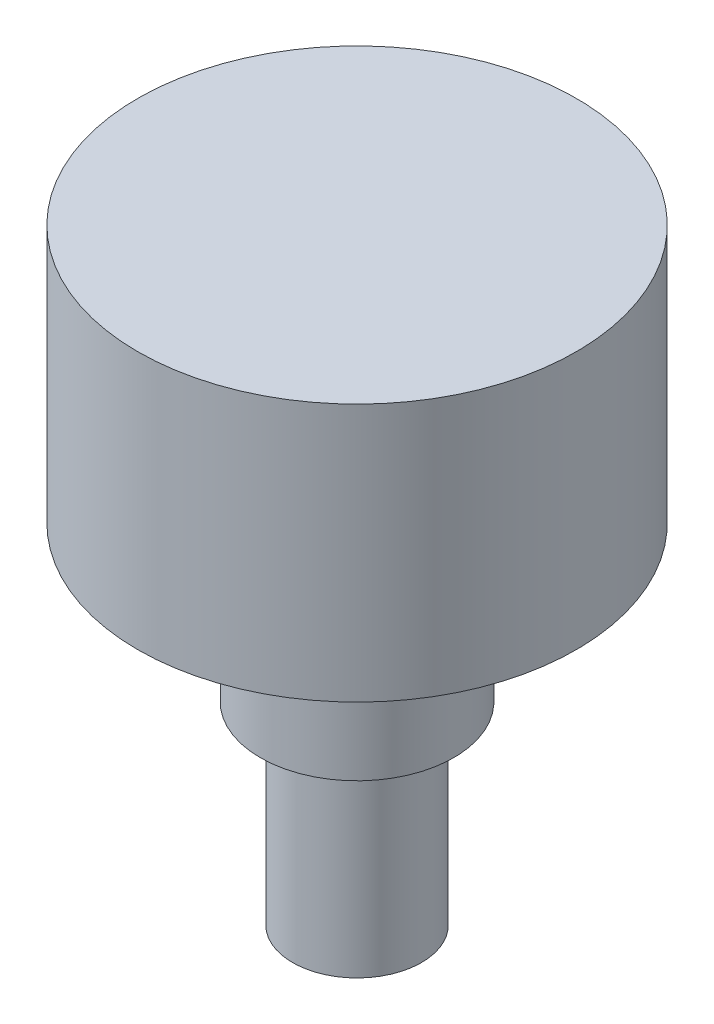
ISO-10303-21;
HEADER;
FILE_DESCRIPTION(('STEP AP214'),'2;1');
FILE_NAME('part.step','',(''),(''),'','','');
FILE_SCHEMA(('AUTOMOTIVE_DESIGN { 1 0 10303 214 1 1 1 1 }'));
ENDSEC;
DATA;
#1=APPLICATION_CONTEXT('core data for automotive mechanical design processes');
#2=APPLICATION_PROTOCOL_DEFINITION('international standard','automotive_design',2000,#1);
#3=PRODUCT_CONTEXT('',#1,'mechanical');
#4=PRODUCT('Part','Part','',(#3));
#5=PRODUCT_RELATED_PRODUCT_CATEGORY('part','',(#4));
#6=PRODUCT_DEFINITION_FORMATION('','',#4);
#7=PRODUCT_DEFINITION_CONTEXT('part definition',#1,'design');
#8=PRODUCT_DEFINITION('design','',#6,#7);
#9=PRODUCT_DEFINITION_SHAPE('','',#8);
#10=(LENGTH_UNIT() NAMED_UNIT(*) SI_UNIT(.MILLI.,.METRE.));
#11=(NAMED_UNIT(*) PLANE_ANGLE_UNIT() SI_UNIT($,.RADIAN.));
#12=(NAMED_UNIT(*) SI_UNIT($,.STERADIAN.) SOLID_ANGLE_UNIT());
#13=UNCERTAINTY_MEASURE_WITH_UNIT(LENGTH_MEASURE(1.E-05),#10,'distance_accuracy_value','');
#14=(GEOMETRIC_REPRESENTATION_CONTEXT(3) GLOBAL_UNCERTAINTY_ASSIGNED_CONTEXT((#13)) GLOBAL_UNIT_ASSIGNED_CONTEXT((#10,
#11,#12)) REPRESENTATION_CONTEXT('',''));
#15=CARTESIAN_POINT('',(0.,0.,0.));
#16=DIRECTION('',(0.,0.,1.));
#17=DIRECTION('',(1.,0.,0.));
#18=AXIS2_PLACEMENT_3D('',#15,#16,#17);
#19=CARTESIAN_POINT('',(0.,-17.145,0.));
#20=DIRECTION('',(0.,1.,0.));
#21=DIRECTION('',(0.,0.,1.));
#22=AXIS2_PLACEMENT_3D('',#19,#20,#21);
#23=CYLINDRICAL_SURFACE('',#22,4.7625);
#24=CARTESIAN_POINT('',(0.,0.,0.));
#25=DIRECTION('',(0.,1.,0.));
#26=DIRECTION('',(0.,0.,1.));
#27=AXIS2_PLACEMENT_3D('',#24,#25,#26);
#28=CIRCLE('',#27,4.7625);
#29=CARTESIAN_POINT('',(0.,0.,4.7625));
#30=VERTEX_POINT('',#29);
#31=EDGE_CURVE('E11',#30,#30,#28,.F.);
#32=ORIENTED_EDGE('',*,*,#31,.T.);
#33=EDGE_LOOP('',(#32));
#34=FACE_BOUND('',#33,.T.);
#35=CARTESIAN_POINT('',(0.,-7.62,0.));
#36=DIRECTION('',(0.,-1.,0.));
#37=DIRECTION('',(0.,0.,-1.));
#38=AXIS2_PLACEMENT_3D('',#35,#36,#37);
#39=CIRCLE('',#38,4.7625);
#40=CARTESIAN_POINT('',(0.,-7.62,-4.7625));
#41=VERTEX_POINT('',#40);
#42=EDGE_CURVE('E39',#41,#41,#39,.T.);
#43=ORIENTED_EDGE('',*,*,#42,.F.);
#44=EDGE_LOOP('',(#43));
#45=FACE_BOUND('',#44,.T.);
#46=ADVANCED_FACE('F35',(#34,#45),#23,.T.);
#47=CARTESIAN_POINT('',(0.,0.,0.));
#48=DIRECTION('',(0.,1.,0.));
#49=DIRECTION('',(0.,0.,1.));
#50=AXIS2_PLACEMENT_3D('',#47,#48,#49);
#51=PLANE('',#50);
#52=CARTESIAN_POINT('',(0.,0.,0.));
#53=DIRECTION('',(0.,1.,0.));
#54=DIRECTION('',(0.,0.,1.));
#55=AXIS2_PLACEMENT_3D('',#52,#53,#54);
#56=CIRCLE('',#55,10.795);
#57=CARTESIAN_POINT('',(0.,0.,10.795));
#58=VERTEX_POINT('',#57);
#59=EDGE_CURVE('E47',#58,#58,#56,.T.);
#60=ORIENTED_EDGE('',*,*,#59,.F.);
#61=EDGE_LOOP('',(#60));
#62=FACE_BOUND('',#61,.T.);
#63=ORIENTED_EDGE('',*,*,#31,.F.);
#64=EDGE_LOOP('',(#63));
#65=FACE_BOUND('',#64,.T.);
#66=ADVANCED_FACE('F65',(#62,#65),#51,.F.);
#67=CARTESIAN_POINT('',(0.,12.7,0.));
#68=DIRECTION('',(0.,-1.,0.));
#69=DIRECTION('',(0.,0.,-1.));
#70=AXIS2_PLACEMENT_3D('',#67,#68,#69);
#71=CYLINDRICAL_SURFACE('',#70,10.795);
#72=CARTESIAN_POINT('',(0.,12.7,0.));
#73=DIRECTION('',(0.,1.,0.));
#74=DIRECTION('',(0.,0.,1.));
#75=AXIS2_PLACEMENT_3D('',#72,#73,#74);
#76=CIRCLE('',#75,10.795);
#77=CARTESIAN_POINT('',(0.,12.7,10.795));
#78=VERTEX_POINT('',#77);
#79=EDGE_CURVE('E43',#78,#78,#76,.T.);
#80=ORIENTED_EDGE('',*,*,#79,.F.);
#81=EDGE_LOOP('',(#80));
#82=FACE_BOUND('',#81,.T.);
#83=ORIENTED_EDGE('',*,*,#59,.T.);
#84=EDGE_LOOP('',(#83));
#85=FACE_BOUND('',#84,.T.);
#86=ADVANCED_FACE('F37',(#82,#85),#71,.T.);
#87=CARTESIAN_POINT('',(0.,12.7,0.));
#88=DIRECTION('',(0.,1.,0.));
#89=DIRECTION('',(0.,0.,1.));
#90=AXIS2_PLACEMENT_3D('',#87,#88,#89);
#91=PLANE('',#90);
#92=ORIENTED_EDGE('',*,*,#79,.T.);
#93=EDGE_LOOP('',(#92));
#94=FACE_BOUND('',#93,.T.);
#95=ADVANCED_FACE('F75',(#94),#91,.T.);
#96=CARTESIAN_POINT('',(0.,-7.62,0.));
#97=DIRECTION('',(0.,-1.,0.));
#98=DIRECTION('',(0.,0.,-1.));
#99=AXIS2_PLACEMENT_3D('',#96,#97,#98);
#100=PLANE('',#99);
#101=CARTESIAN_POINT('',(0.,-7.62,0.));
#102=DIRECTION('',(0.,-1.,0.));
#103=DIRECTION('',(0.,0.,-1.));
#104=AXIS2_PLACEMENT_3D('',#101,#102,#103);
#105=CIRCLE('',#104,3.175);
#106=CARTESIAN_POINT('',(0.,-7.62,-3.175));
#107=VERTEX_POINT('',#106);
#108=EDGE_CURVE('E55',#107,#107,#105,.T.);
#109=ORIENTED_EDGE('',*,*,#108,.F.);
#110=EDGE_LOOP('',(#109));
#111=FACE_BOUND('',#110,.T.);
#112=ORIENTED_EDGE('',*,*,#42,.T.);
#113=EDGE_LOOP('',(#112));
#114=FACE_BOUND('',#113,.T.);
#115=ADVANCED_FACE('F62',(#111,#114),#100,.T.);
#116=CARTESIAN_POINT('',(0.,-7.62,0.));
#117=DIRECTION('',(0.,-1.,0.));
#118=DIRECTION('',(0.,0.,-1.));
#119=AXIS2_PLACEMENT_3D('',#116,#117,#118);
#120=CYLINDRICAL_SURFACE('',#119,3.175);
#121=ORIENTED_EDGE('',*,*,#108,.T.);
#122=EDGE_LOOP('',(#121));
#123=FACE_BOUND('',#122,.T.);
#124=CARTESIAN_POINT('',(0.,-17.145,0.));
#125=DIRECTION('',(0.,-1.,0.));
#126=DIRECTION('',(0.,0.,-1.));
#127=AXIS2_PLACEMENT_3D('',#124,#125,#126);
#128=CIRCLE('',#127,3.175);
#129=CARTESIAN_POINT('',(0.,-17.145,-3.175));
#130=VERTEX_POINT('',#129);
#131=EDGE_CURVE('E52',#130,#130,#128,.T.);
#132=ORIENTED_EDGE('',*,*,#131,.F.);
#133=EDGE_LOOP('',(#132));
#134=FACE_BOUND('',#133,.T.);
#135=ADVANCED_FACE('F82',(#123,#134),#120,.T.);
#136=CARTESIAN_POINT('',(0.,-17.145,0.));
#137=DIRECTION('',(0.,-1.,0.));
#138=DIRECTION('',(0.,0.,-1.));
#139=AXIS2_PLACEMENT_3D('',#136,#137,#138);
#140=PLANE('',#139);
#141=ORIENTED_EDGE('',*,*,#131,.T.);
#142=EDGE_LOOP('',(#141));
#143=FACE_BOUND('',#142,.T.);
#144=ADVANCED_FACE('F73',(#143),#140,.T.);
#145=CLOSED_SHELL('',(#46,#66,#86,#95,#115,#135,#144));
#146=MANIFOLD_SOLID_BREP('B2',#145);
#147=ADVANCED_BREP_SHAPE_REPRESENTATION('',(#18,#146),#14);
#148=SHAPE_DEFINITION_REPRESENTATION(#9,#147);
ENDSEC;
END-ISO-10303-21;
